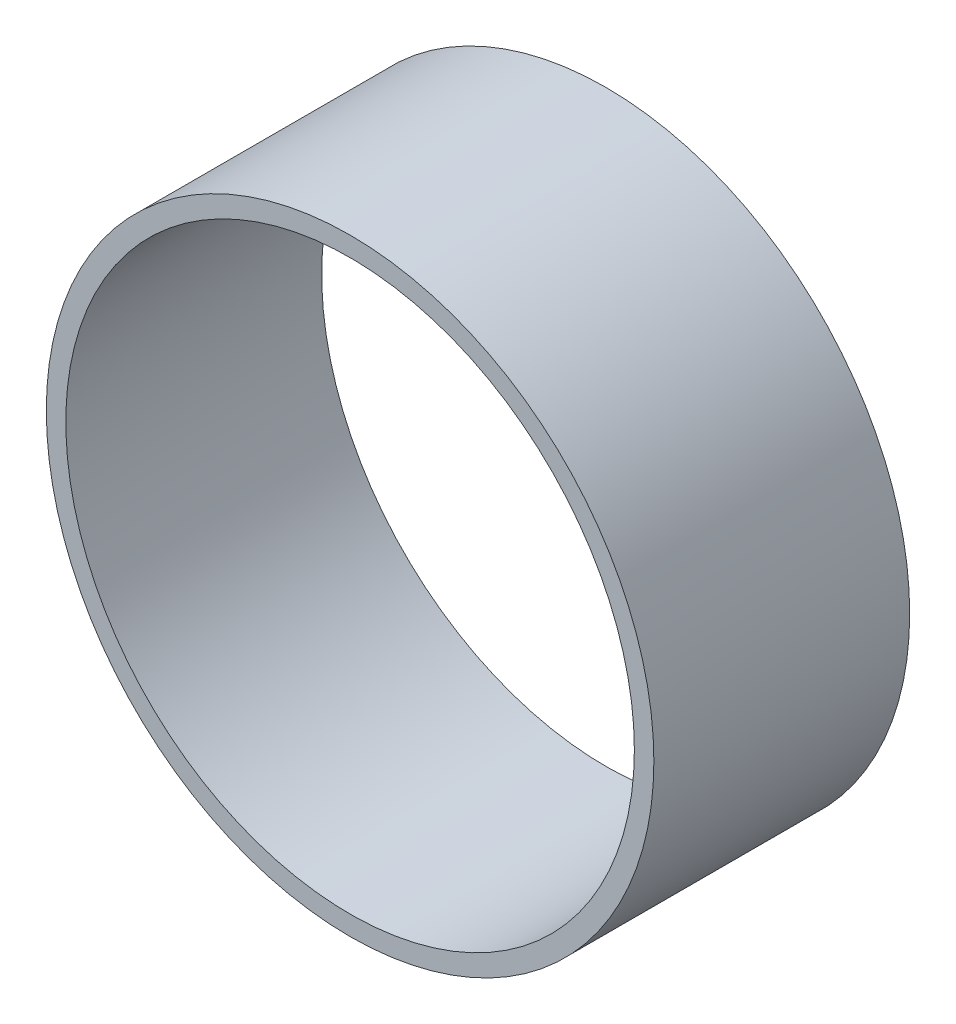
ISO-10303-21;
HEADER;
FILE_DESCRIPTION(('STEP AP214'),'2;1');
FILE_NAME('part.step','',(''),(''),'','','');
FILE_SCHEMA(('AUTOMOTIVE_DESIGN { 1 0 10303 214 1 1 1 1 }'));
ENDSEC;
DATA;
#1=APPLICATION_CONTEXT('core data for automotive mechanical design processes');
#2=APPLICATION_PROTOCOL_DEFINITION('international standard','automotive_design',2000,#1);
#3=PRODUCT_CONTEXT('',#1,'mechanical');
#4=PRODUCT('Part','Part','',(#3));
#5=PRODUCT_RELATED_PRODUCT_CATEGORY('part','',(#4));
#6=PRODUCT_DEFINITION_FORMATION('','',#4);
#7=PRODUCT_DEFINITION_CONTEXT('part definition',#1,'design');
#8=PRODUCT_DEFINITION('design','',#6,#7);
#9=PRODUCT_DEFINITION_SHAPE('','',#8);
#10=(LENGTH_UNIT() NAMED_UNIT(*) SI_UNIT(.MILLI.,.METRE.));
#11=(NAMED_UNIT(*) PLANE_ANGLE_UNIT() SI_UNIT($,.RADIAN.));
#12=(NAMED_UNIT(*) SI_UNIT($,.STERADIAN.) SOLID_ANGLE_UNIT());
#13=UNCERTAINTY_MEASURE_WITH_UNIT(LENGTH_MEASURE(1.E-05),#10,'distance_accuracy_value','');
#14=(GEOMETRIC_REPRESENTATION_CONTEXT(3) GLOBAL_UNCERTAINTY_ASSIGNED_CONTEXT((#13)) GLOBAL_UNIT_ASSIGNED_CONTEXT((#10,
#11,#12)) REPRESENTATION_CONTEXT('',''));
#15=CARTESIAN_POINT('',(0.,0.,0.));
#16=DIRECTION('',(0.,0.,1.));
#17=DIRECTION('',(1.,0.,0.));
#18=AXIS2_PLACEMENT_3D('',#15,#16,#17);
#19=CARTESIAN_POINT('',(0.,0.,20.));
#20=DIRECTION('',(0.,0.,1.));
#21=DIRECTION('',(1.,0.,0.));
#22=AXIS2_PLACEMENT_3D('',#19,#20,#21);
#23=PLANE('',#22);
#24=CARTESIAN_POINT('',(0.,0.,20.));
#25=DIRECTION('',(0.,0.,1.));
#26=DIRECTION('',(1.,0.,0.));
#27=AXIS2_PLACEMENT_3D('',#24,#25,#26);
#28=CIRCLE('',#27,23.75);
#29=CARTESIAN_POINT('',(23.75,0.,20.));
#30=VERTEX_POINT('',#29);
#31=EDGE_CURVE('E10',#30,#30,#28,.T.);
#32=ORIENTED_EDGE('',*,*,#31,.T.);
#33=EDGE_LOOP('',(#32));
#34=FACE_BOUND('',#33,.T.);
#35=CARTESIAN_POINT('',(0.,0.,20.));
#36=DIRECTION('',(0.,0.,1.));
#37=DIRECTION('',(1.,0.,0.));
#38=AXIS2_PLACEMENT_3D('',#35,#36,#37);
#39=CIRCLE('',#38,22.225);
#40=CARTESIAN_POINT('',(22.225,0.,20.));
#41=VERTEX_POINT('',#40);
#42=EDGE_CURVE('E44',#41,#41,#39,.T.);
#43=ORIENTED_EDGE('',*,*,#42,.F.);
#44=EDGE_LOOP('',(#43));
#45=FACE_BOUND('',#44,.T.);
#46=ADVANCED_FACE('F33',(#34,#45),#23,.T.);
#47=CARTESIAN_POINT('',(0.,0.,0.));
#48=DIRECTION('',(0.,0.,1.));
#49=DIRECTION('',(1.,0.,0.));
#50=AXIS2_PLACEMENT_3D('',#47,#48,#49);
#51=PLANE('',#50);
#52=CARTESIAN_POINT('',(0.,0.,0.));
#53=DIRECTION('',(0.,0.,1.));
#54=DIRECTION('',(1.,0.,0.));
#55=AXIS2_PLACEMENT_3D('',#52,#53,#54);
#56=CIRCLE('',#55,23.75);
#57=CARTESIAN_POINT('',(23.75,0.,0.));
#58=VERTEX_POINT('',#57);
#59=EDGE_CURVE('E37',#58,#58,#56,.T.);
#60=ORIENTED_EDGE('',*,*,#59,.F.);
#61=EDGE_LOOP('',(#60));
#62=FACE_BOUND('',#61,.T.);
#63=CARTESIAN_POINT('',(0.,0.,0.));
#64=DIRECTION('',(0.,0.,1.));
#65=DIRECTION('',(1.,0.,0.));
#66=AXIS2_PLACEMENT_3D('',#63,#64,#65);
#67=CIRCLE('',#66,22.225);
#68=CARTESIAN_POINT('',(22.225,0.,0.));
#69=VERTEX_POINT('',#68);
#70=EDGE_CURVE('E46',#69,#69,#67,.T.);
#71=ORIENTED_EDGE('',*,*,#70,.T.);
#72=EDGE_LOOP('',(#71));
#73=FACE_BOUND('',#72,.T.);
#74=ADVANCED_FACE('F56',(#62,#73),#51,.F.);
#75=CARTESIAN_POINT('',(0.,0.,20.));
#76=DIRECTION('',(0.,0.,-1.));
#77=DIRECTION('',(-1.,0.,0.));
#78=AXIS2_PLACEMENT_3D('',#75,#76,#77);
#79=CYLINDRICAL_SURFACE('',#78,23.75);
#80=ORIENTED_EDGE('',*,*,#31,.F.);
#81=EDGE_LOOP('',(#80));
#82=FACE_BOUND('',#81,.T.);
#83=ORIENTED_EDGE('',*,*,#59,.T.);
#84=EDGE_LOOP('',(#83));
#85=FACE_BOUND('',#84,.T.);
#86=ADVANCED_FACE('F35',(#82,#85),#79,.T.);
#87=CARTESIAN_POINT('',(0.,0.,20.));
#88=DIRECTION('',(0.,0.,-1.));
#89=DIRECTION('',(-1.,0.,0.));
#90=AXIS2_PLACEMENT_3D('',#87,#88,#89);
#91=CYLINDRICAL_SURFACE('',#90,22.225);
#92=ORIENTED_EDGE('',*,*,#42,.T.);
#93=EDGE_LOOP('',(#92));
#94=FACE_BOUND('',#93,.T.);
#95=ORIENTED_EDGE('',*,*,#70,.F.);
#96=EDGE_LOOP('',(#95));
#97=FACE_BOUND('',#96,.T.);
#98=ADVANCED_FACE('F52',(#94,#97),#91,.F.);
#99=CLOSED_SHELL('',(#46,#74,#86,#98));
#100=MANIFOLD_SOLID_BREP('B2',#99);
#101=ADVANCED_BREP_SHAPE_REPRESENTATION('',(#18,#100),#14);
#102=SHAPE_DEFINITION_REPRESENTATION(#9,#101);
ENDSEC;
END-ISO-10303-21;
